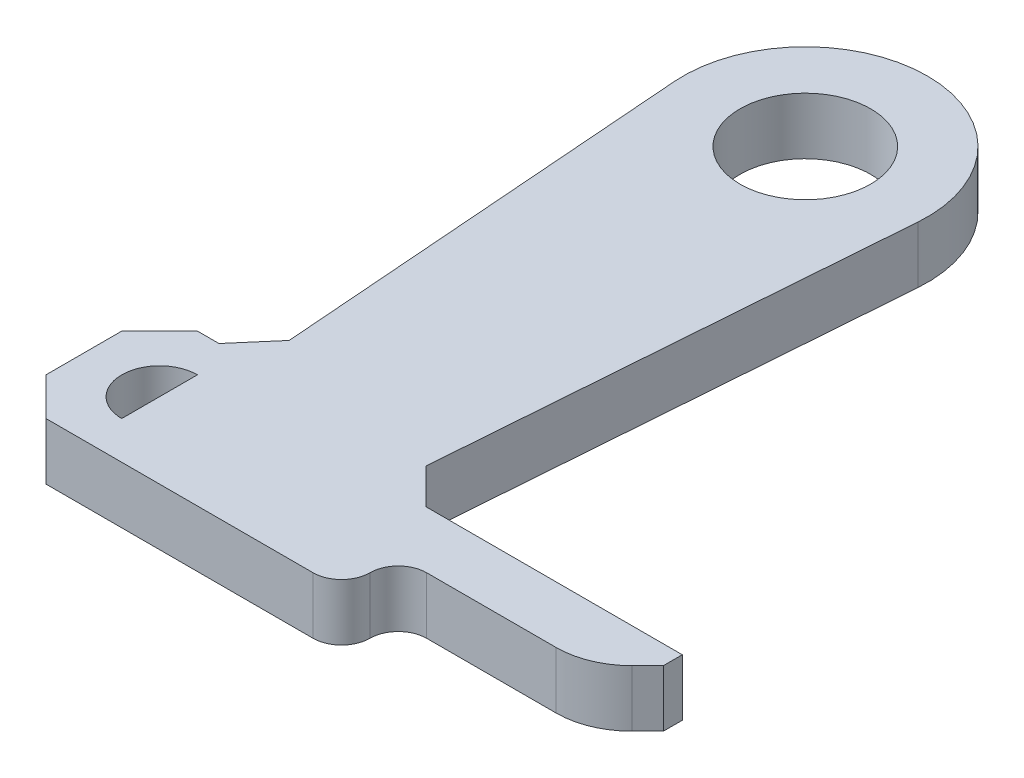
ISO-10303-21;
HEADER;
FILE_DESCRIPTION(('STEP AP214'),'2;1');
FILE_NAME('part.step','',(''),(''),'','','');
FILE_SCHEMA(('AUTOMOTIVE_DESIGN { 1 0 10303 214 1 1 1 1 }'));
ENDSEC;
DATA;
#1=APPLICATION_CONTEXT('core data for automotive mechanical design processes');
#2=APPLICATION_PROTOCOL_DEFINITION('international standard','automotive_design',2000,#1);
#3=PRODUCT_CONTEXT('',#1,'mechanical');
#4=PRODUCT('Part','Part','',(#3));
#5=PRODUCT_RELATED_PRODUCT_CATEGORY('part','',(#4));
#6=PRODUCT_DEFINITION_FORMATION('','',#4);
#7=PRODUCT_DEFINITION_CONTEXT('part definition',#1,'design');
#8=PRODUCT_DEFINITION('design','',#6,#7);
#9=PRODUCT_DEFINITION_SHAPE('','',#8);
#10=(LENGTH_UNIT() NAMED_UNIT(*) SI_UNIT(.MILLI.,.METRE.));
#11=(NAMED_UNIT(*) PLANE_ANGLE_UNIT() SI_UNIT($,.RADIAN.));
#12=(NAMED_UNIT(*) SI_UNIT($,.STERADIAN.) SOLID_ANGLE_UNIT());
#13=UNCERTAINTY_MEASURE_WITH_UNIT(LENGTH_MEASURE(1.E-05),#10,'distance_accuracy_value','');
#14=(GEOMETRIC_REPRESENTATION_CONTEXT(3) GLOBAL_UNCERTAINTY_ASSIGNED_CONTEXT((#13)) GLOBAL_UNIT_ASSIGNED_CONTEXT((#10,
#11,#12)) REPRESENTATION_CONTEXT('',''));
#15=CARTESIAN_POINT('',(0.,0.,0.));
#16=DIRECTION('',(0.,0.,1.));
#17=DIRECTION('',(1.,0.,0.));
#18=AXIS2_PLACEMENT_3D('',#15,#16,#17);
#19=CARTESIAN_POINT('',(-4.,1.5,29.05));
#20=DIRECTION('',(0.99712774336546,0.,-0.0757381238934818));
#21=DIRECTION('',(-0.0757381238934818,0.,-0.997127743365461));
#22=AXIS2_PLACEMENT_3D('',#19,#20,#21);
#23=PLANE('',#22);
#24=DIRECTION('',(0.0757381238934818,0.,0.997127743365461));
#25=VECTOR('',#24,1.);
#26=CARTESIAN_POINT('',(-4.,-1.5,29.05));
#27=LINE('',#26,#25);
#28=CARTESIAN_POINT('',(-6.43147394470722,-1.5,-2.96148910088704));
#29=VERTEX_POINT('',#28);
#30=CARTESIAN_POINT('',(-4.75912656659449,-1.5,19.0557445132691));
#31=VERTEX_POINT('',#30);
#32=EDGE_CURVE('E236',#29,#31,#27,.T.);
#33=ORIENTED_EDGE('',*,*,#32,.T.);
#34=DIRECTION('',(0.,1.,0.));
#35=VECTOR('',#34,1.);
#36=CARTESIAN_POINT('',(-4.75912656659449,1.5,19.0557445132691));
#37=LINE('',#36,#35);
#38=CARTESIAN_POINT('',(-4.75912656659449,1.5,19.0557445132691));
#39=VERTEX_POINT('',#38);
#40=EDGE_CURVE('E61',#31,#39,#37,.T.);
#41=ORIENTED_EDGE('',*,*,#40,.T.);
#42=DIRECTION('',(0.0757381238934818,0.,0.997127743365461));
#43=VECTOR('',#42,1.);
#44=CARTESIAN_POINT('',(-4.,1.5,29.05));
#45=LINE('',#44,#43);
#46=CARTESIAN_POINT('',(-6.43147394470722,1.5,-2.96148910088704));
#47=VERTEX_POINT('',#46);
#48=EDGE_CURVE('E240',#47,#39,#45,.T.);
#49=ORIENTED_EDGE('',*,*,#48,.F.);
#50=DIRECTION('',(0.,-1.,0.));
#51=VECTOR('',#50,1.);
#52=CARTESIAN_POINT('',(-6.43147394470722,1.5,-2.96148910088704));
#53=LINE('',#52,#51);
#54=EDGE_CURVE('E242',#47,#29,#53,.T.);
#55=ORIENTED_EDGE('',*,*,#54,.T.);
#56=EDGE_LOOP('',(#33,#41,#49,#55));
#57=FACE_BOUND('',#56,.T.);
#58=ADVANCED_FACE('F39',(#57),#23,.F.);
#59=CARTESIAN_POINT('',(4.,1.5,29.05));
#60=DIRECTION('',(-0.99712774336546,0.,-0.0757381238934818));
#61=DIRECTION('',(-0.0757381238934818,0.,0.997127743365461));
#62=AXIS2_PLACEMENT_3D('',#59,#60,#61);
#63=PLANE('',#62);
#64=DIRECTION('',(0.0757381238934818,0.,-0.997127743365461));
#65=VECTOR('',#64,1.);
#66=CARTESIAN_POINT('',(4.,1.5,29.05));
#67=LINE('',#66,#65);
#68=CARTESIAN_POINT('',(4.59692616946738,1.5,21.1911884303617));
#69=VERTEX_POINT('',#68);
#70=CARTESIAN_POINT('',(6.43147394470722,1.5,-2.96148910088704));
#71=VERTEX_POINT('',#70);
#72=EDGE_CURVE('E235',#69,#71,#67,.T.);
#73=ORIENTED_EDGE('',*,*,#72,.F.);
#74=DIRECTION('',(0.,-1.,0.));
#75=VECTOR('',#74,1.);
#76=CARTESIAN_POINT('',(4.59692616946738,-1.5,21.1911884303617));
#77=LINE('',#76,#75);
#78=CARTESIAN_POINT('',(4.59692616946738,-1.5,21.1911884303617));
#79=VERTEX_POINT('',#78);
#80=EDGE_CURVE('E306',#69,#79,#77,.T.);
#81=ORIENTED_EDGE('',*,*,#80,.T.);
#82=DIRECTION('',(0.0757381238934818,0.,-0.997127743365461));
#83=VECTOR('',#82,1.);
#84=CARTESIAN_POINT('',(4.,-1.5,29.05));
#85=LINE('',#84,#83);
#86=CARTESIAN_POINT('',(6.43147394470722,-1.5,-2.96148910088704));
#87=VERTEX_POINT('',#86);
#88=EDGE_CURVE('E244',#79,#87,#85,.T.);
#89=ORIENTED_EDGE('',*,*,#88,.T.);
#90=DIRECTION('',(0.,-1.,0.));
#91=VECTOR('',#90,1.);
#92=CARTESIAN_POINT('',(6.43147394470722,1.5,-2.96148910088704));
#93=LINE('',#92,#91);
#94=EDGE_CURVE('E251',#71,#87,#93,.T.);
#95=ORIENTED_EDGE('',*,*,#94,.F.);
#96=EDGE_LOOP('',(#73,#81,#89,#95));
#97=FACE_BOUND('',#96,.T.);
#98=ADVANCED_FACE('F327',(#97),#63,.F.);
#99=CARTESIAN_POINT('',(0.,1.5,-3.45));
#100=DIRECTION('',(0.,1.,0.));
#101=DIRECTION('',(0.,0.,1.));
#102=AXIS2_PLACEMENT_3D('',#99,#100,#101);
#103=PLANE('',#102);
#104=CARTESIAN_POINT('',(-5.60765031880753,1.5,25.05));
#105=DIRECTION('',(0.,1.,0.));
#106=DIRECTION('',(0.,0.,1.));
#107=AXIS2_PLACEMENT_3D('',#104,#105,#106);
#108=CIRCLE('',#107,2.);
#109=CARTESIAN_POINT('',(-5.60765031880753,1.5,23.05));
#110=VERTEX_POINT('',#109);
#111=CARTESIAN_POINT('',(-5.60765031880753,1.5,27.05));
#112=VERTEX_POINT('',#111);
#113=EDGE_CURVE('E174',#110,#112,#108,.T.);
#114=ORIENTED_EDGE('',*,*,#113,.F.);
#115=DIRECTION('',(0.,0.,-1.));
#116=VECTOR('',#115,1.);
#117=CARTESIAN_POINT('',(-5.60765031880753,1.5,23.05));
#118=LINE('',#117,#116);
#119=EDGE_CURVE('E185',#112,#110,#118,.T.);
#120=ORIENTED_EDGE('',*,*,#119,.F.);
#121=EDGE_LOOP('',(#114,#120));
#122=FACE_BOUND('',#121,.T.);
#123=DIRECTION('',(0.,0.,1.));
#124=VECTOR('',#123,1.);
#125=CARTESIAN_POINT('',(-9.60765031880753,1.5,21.05));
#126=LINE('',#125,#124);
#127=CARTESIAN_POINT('',(-9.60765031880753,1.5,23.05));
#128=VERTEX_POINT('',#127);
#129=CARTESIAN_POINT('',(-9.60765031880753,1.5,27.05));
#130=VERTEX_POINT('',#129);
#131=EDGE_CURVE('E204',#128,#130,#126,.T.);
#132=ORIENTED_EDGE('',*,*,#131,.T.);
#133=DIRECTION('',(-0.707106781186546,0.,-0.707106781186549));
#134=VECTOR('',#133,1.);
#135=CARTESIAN_POINT('',(-20.0538251594038,1.5,16.6038251594037));
#136=LINE('',#135,#134);
#137=CARTESIAN_POINT('',(-7.60765031880752,1.5,29.05));
#138=VERTEX_POINT('',#137);
#139=EDGE_CURVE('E301',#130,#138,#136,.F.);
#140=ORIENTED_EDGE('',*,*,#139,.T.);
#141=DIRECTION('',(1.,0.,0.));
#142=VECTOR('',#141,1.);
#143=CARTESIAN_POINT('',(-4.,1.5,29.05));
#144=LINE('',#143,#142);
#145=CARTESIAN_POINT('',(6.5,1.5,29.05));
#146=VERTEX_POINT('',#145);
#147=EDGE_CURVE('E233',#138,#146,#144,.T.);
#148=ORIENTED_EDGE('',*,*,#147,.T.);
#149=CARTESIAN_POINT('',(6.5,1.5,27.55));
#150=DIRECTION('',(0.,1.,0.));
#151=DIRECTION('',(0.,0.,1.));
#152=AXIS2_PLACEMENT_3D('',#149,#150,#151);
#153=CIRCLE('',#152,1.5);
#154=CARTESIAN_POINT('',(8.,1.5,27.55));
#155=VERTEX_POINT('',#154);
#156=EDGE_CURVE('E266',#146,#155,#153,.T.);
#157=ORIENTED_EDGE('',*,*,#156,.T.);
#158=CARTESIAN_POINT('',(9.5,1.5,27.55));
#159=DIRECTION('',(0.,1.,0.));
#160=DIRECTION('',(0.,0.,1.));
#161=AXIS2_PLACEMENT_3D('',#158,#159,#160);
#162=CIRCLE('',#161,1.5);
#163=CARTESIAN_POINT('',(9.5,1.5,26.05));
#164=VERTEX_POINT('',#163);
#165=EDGE_CURVE('E280',#155,#164,#162,.F.);
#166=ORIENTED_EDGE('',*,*,#165,.T.);
#167=DIRECTION('',(-1.,0.,0.));
#168=VECTOR('',#167,1.);
#169=CARTESIAN_POINT('',(20.,1.5,26.05));
#170=LINE('',#169,#168);
#171=CARTESIAN_POINT('',(16.3431457505076,1.5,26.05));
#172=VERTEX_POINT('',#171);
#173=EDGE_CURVE('E197',#172,#164,#170,.T.);
#174=ORIENTED_EDGE('',*,*,#173,.F.);
#175=CARTESIAN_POINT('',(16.3431457505076,1.5,22.05));
#176=DIRECTION('',(0.,1.,0.));
#177=DIRECTION('',(0.,0.,1.));
#178=AXIS2_PLACEMENT_3D('',#175,#176,#177);
#179=CIRCLE('',#178,4.);
#180=CARTESIAN_POINT('',(19.1715728752538,1.5,24.8784271247462));
#181=VERTEX_POINT('',#180);
#182=EDGE_CURVE('E268',#172,#181,#179,.T.);
#183=ORIENTED_EDGE('',*,*,#182,.T.);
#184=DIRECTION('',(-0.707106781186546,0.,0.707106781186549));
#185=VECTOR('',#184,1.);
#186=CARTESIAN_POINT('',(23.75,1.5,20.2999999999999));
#187=LINE('',#186,#185);
#188=CARTESIAN_POINT('',(20.,1.5,24.05));
#189=VERTEX_POINT('',#188);
#190=EDGE_CURVE('E254',#181,#189,#187,.F.);
#191=ORIENTED_EDGE('',*,*,#190,.T.);
#192=DIRECTION('',(0.,0.,-1.));
#193=VECTOR('',#192,1.);
#194=CARTESIAN_POINT('',(20.,1.5,23.05));
#195=LINE('',#194,#193);
#196=CARTESIAN_POINT('',(20.,1.5,23.05));
#197=VERTEX_POINT('',#196);
#198=EDGE_CURVE('E214',#189,#197,#195,.T.);
#199=ORIENTED_EDGE('',*,*,#198,.T.);
#200=DIRECTION('',(-1.,0.,0.));
#201=VECTOR('',#200,1.);
#202=CARTESIAN_POINT('',(4.45573773910565,1.5,23.05));
#203=LINE('',#202,#201);
#204=CARTESIAN_POINT('',(6.45573773910565,1.5,23.05));
#205=VERTEX_POINT('',#204);
#206=EDGE_CURVE('E216',#197,#205,#203,.T.);
#207=ORIENTED_EDGE('',*,*,#206,.T.);
#208=DIRECTION('',(0.707106781186544,0.,0.707106781186551));
#209=VECTOR('',#208,1.);
#210=CARTESIAN_POINT('',(4.59692616946738,1.5,21.1911884303617));
#211=LINE('',#210,#209);
#212=EDGE_CURVE('E317',#205,#69,#211,.F.);
#213=ORIENTED_EDGE('',*,*,#212,.T.);
#214=ORIENTED_EDGE('',*,*,#72,.T.);
#215=CARTESIAN_POINT('',(0.,1.5,-3.45));
#216=DIRECTION('',(0.,1.,0.));
#217=DIRECTION('',(0.,0.,1.));
#218=AXIS2_PLACEMENT_3D('',#215,#216,#217);
#219=CIRCLE('',#218,6.45);
#220=EDGE_CURVE('E238',#71,#47,#219,.T.);
#221=ORIENTED_EDGE('',*,*,#220,.T.);
#222=ORIENTED_EDGE('',*,*,#48,.T.);
#223=DIRECTION('',(0.651520848043532,0.,-0.758630730042381));
#224=VECTOR('',#223,1.);
#225=CARTESIAN_POINT('',(-6.47181625141362,1.5,21.05));
#226=LINE('',#225,#224);
#227=CARTESIAN_POINT('',(-6.47181625141362,1.5,21.05));
#228=VERTEX_POINT('',#227);
#229=EDGE_CURVE('E12',#39,#228,#226,.F.);
#230=ORIENTED_EDGE('',*,*,#229,.T.);
#231=DIRECTION('',(-1.,0.,0.));
#232=VECTOR('',#231,1.);
#233=CARTESIAN_POINT('',(-9.60765031880753,1.5,21.05));
#234=LINE('',#233,#232);
#235=CARTESIAN_POINT('',(-7.60765031880751,1.5,21.05));
#236=VERTEX_POINT('',#235);
#237=EDGE_CURVE('E207',#228,#236,#234,.T.);
#238=ORIENTED_EDGE('',*,*,#237,.T.);
#239=DIRECTION('',(0.707106781186549,0.,-0.707106781186546));
#240=VECTOR('',#239,1.);
#241=CARTESIAN_POINT('',(8.44617484059626,1.5,4.99617484059629));
#242=LINE('',#241,#240);
#243=EDGE_CURVE('E299',#236,#128,#242,.F.);
#244=ORIENTED_EDGE('',*,*,#243,.T.);
#245=EDGE_LOOP('',(#132,#140,#148,#157,#166,#174,#183,#191,#199,#207,#213,#214,#221,#222,#230,
#238,#244));
#246=FACE_BOUND('',#245,.T.);
#247=CARTESIAN_POINT('',(0.,1.5,-3.45));
#248=DIRECTION('',(0.,1.,0.));
#249=DIRECTION('',(0.,0.,1.));
#250=AXIS2_PLACEMENT_3D('',#247,#248,#249);
#251=CIRCLE('',#250,3.45);
#252=CARTESIAN_POINT('',(0.,1.5,0.));
#253=VERTEX_POINT('',#252);
#254=EDGE_CURVE('E227',#253,#253,#251,.T.);
#255=ORIENTED_EDGE('',*,*,#254,.F.);
#256=EDGE_LOOP('',(#255));
#257=FACE_BOUND('',#256,.T.);
#258=ADVANCED_FACE('F189',(#122,#246,#257),#103,.T.);
#259=CARTESIAN_POINT('',(0.,-1.5,-3.45));
#260=DIRECTION('',(0.,1.,0.));
#261=DIRECTION('',(0.,0.,1.));
#262=AXIS2_PLACEMENT_3D('',#259,#260,#261);
#263=PLANE('',#262);
#264=DIRECTION('',(0.,0.,-1.));
#265=VECTOR('',#264,1.);
#266=CARTESIAN_POINT('',(-5.60765031880753,-1.5,23.05));
#267=LINE('',#266,#265);
#268=CARTESIAN_POINT('',(-5.60765031880753,-1.5,27.05));
#269=VERTEX_POINT('',#268);
#270=CARTESIAN_POINT('',(-5.60765031880753,-1.5,23.05));
#271=VERTEX_POINT('',#270);
#272=EDGE_CURVE('E194',#269,#271,#267,.T.);
#273=ORIENTED_EDGE('',*,*,#272,.T.);
#274=CARTESIAN_POINT('',(-5.60765031880753,-1.5,25.05));
#275=DIRECTION('',(0.,1.,0.));
#276=DIRECTION('',(0.,0.,1.));
#277=AXIS2_PLACEMENT_3D('',#274,#275,#276);
#278=CIRCLE('',#277,2.);
#279=EDGE_CURVE('E177',#271,#269,#278,.T.);
#280=ORIENTED_EDGE('',*,*,#279,.T.);
#281=EDGE_LOOP('',(#273,#280));
#282=FACE_BOUND('',#281,.T.);
#283=DIRECTION('',(1.,0.,0.));
#284=VECTOR('',#283,1.);
#285=CARTESIAN_POINT('',(-4.,-1.5,29.05));
#286=LINE('',#285,#284);
#287=CARTESIAN_POINT('',(-7.60765031880752,-1.5,29.05));
#288=VERTEX_POINT('',#287);
#289=CARTESIAN_POINT('',(6.5,-1.5,29.05));
#290=VERTEX_POINT('',#289);
#291=EDGE_CURVE('E230',#288,#290,#286,.T.);
#292=ORIENTED_EDGE('',*,*,#291,.F.);
#293=DIRECTION('',(0.707106781186546,0.,0.707106781186549));
#294=VECTOR('',#293,1.);
#295=CARTESIAN_POINT('',(-7.60765031880752,-1.5,29.05));
#296=LINE('',#295,#294);
#297=CARTESIAN_POINT('',(-9.60765031880753,-1.5,27.05));
#298=VERTEX_POINT('',#297);
#299=EDGE_CURVE('E292',#288,#298,#296,.F.);
#300=ORIENTED_EDGE('',*,*,#299,.T.);
#301=DIRECTION('',(0.,0.,1.));
#302=VECTOR('',#301,1.);
#303=CARTESIAN_POINT('',(-9.60765031880753,-1.5,21.05));
#304=LINE('',#303,#302);
#305=CARTESIAN_POINT('',(-9.60765031880753,-1.5,23.05));
#306=VERTEX_POINT('',#305);
#307=EDGE_CURVE('E203',#306,#298,#304,.T.);
#308=ORIENTED_EDGE('',*,*,#307,.F.);
#309=DIRECTION('',(-0.707106781186549,0.,0.707106781186546));
#310=VECTOR('',#309,1.);
#311=CARTESIAN_POINT('',(-9.60765031880753,-1.5,23.05));
#312=LINE('',#311,#310);
#313=CARTESIAN_POINT('',(-7.60765031880751,-1.5,21.05));
#314=VERTEX_POINT('',#313);
#315=EDGE_CURVE('E289',#306,#314,#312,.F.);
#316=ORIENTED_EDGE('',*,*,#315,.T.);
#317=DIRECTION('',(-1.,0.,0.));
#318=VECTOR('',#317,1.);
#319=CARTESIAN_POINT('',(-9.60765031880753,-1.5,21.05));
#320=LINE('',#319,#318);
#321=CARTESIAN_POINT('',(-6.47181625141362,-1.5,21.05));
#322=VERTEX_POINT('',#321);
#323=EDGE_CURVE('E208',#322,#314,#320,.T.);
#324=ORIENTED_EDGE('',*,*,#323,.F.);
#325=DIRECTION('',(-0.651520848043532,0.,0.758630730042381));
#326=VECTOR('',#325,1.);
#327=CARTESIAN_POINT('',(8.38479807422438,-1.5,3.75096159522467));
#328=LINE('',#327,#326);
#329=EDGE_CURVE('E48',#322,#31,#328,.F.);
#330=ORIENTED_EDGE('',*,*,#329,.T.);
#331=ORIENTED_EDGE('',*,*,#32,.F.);
#332=CARTESIAN_POINT('',(0.,-1.5,-3.45));
#333=DIRECTION('',(0.,1.,0.));
#334=DIRECTION('',(0.,0.,1.));
#335=AXIS2_PLACEMENT_3D('',#332,#333,#334);
#336=CIRCLE('',#335,6.45);
#337=EDGE_CURVE('E246',#87,#29,#336,.T.);
#338=ORIENTED_EDGE('',*,*,#337,.F.);
#339=ORIENTED_EDGE('',*,*,#88,.F.);
#340=DIRECTION('',(-0.707106781186544,0.,-0.707106781186551));
#341=VECTOR('',#340,1.);
#342=CARTESIAN_POINT('',(-10.0221311304471,-1.5,6.57213113044703));
#343=LINE('',#342,#341);
#344=CARTESIAN_POINT('',(6.45573773910565,-1.5,23.05));
#345=VERTEX_POINT('',#344);
#346=EDGE_CURVE('E315',#79,#345,#343,.F.);
#347=ORIENTED_EDGE('',*,*,#346,.T.);
#348=DIRECTION('',(-1.,0.,0.));
#349=VECTOR('',#348,1.);
#350=CARTESIAN_POINT('',(4.45573773910565,-1.5,23.05));
#351=LINE('',#350,#349);
#352=CARTESIAN_POINT('',(20.,-1.5,23.05));
#353=VERTEX_POINT('',#352);
#354=EDGE_CURVE('E217',#353,#345,#351,.T.);
#355=ORIENTED_EDGE('',*,*,#354,.F.);
#356=DIRECTION('',(0.,0.,-1.));
#357=VECTOR('',#356,1.);
#358=CARTESIAN_POINT('',(20.,-1.5,23.05));
#359=LINE('',#358,#357);
#360=CARTESIAN_POINT('',(20.,-1.5,24.05));
#361=VERTEX_POINT('',#360);
#362=EDGE_CURVE('E210',#361,#353,#359,.T.);
#363=ORIENTED_EDGE('',*,*,#362,.F.);
#364=DIRECTION('',(0.707106781186546,0.,-0.707106781186549));
#365=VECTOR('',#364,1.);
#366=CARTESIAN_POINT('',(18.,-1.5,26.05));
#367=LINE('',#366,#365);
#368=CARTESIAN_POINT('',(19.1715728752538,-1.5,24.8784271247462));
#369=VERTEX_POINT('',#368);
#370=EDGE_CURVE('E258',#361,#369,#367,.F.);
#371=ORIENTED_EDGE('',*,*,#370,.T.);
#372=CARTESIAN_POINT('',(16.3431457505076,-1.5,22.05));
#373=DIRECTION('',(0.,1.,0.));
#374=DIRECTION('',(0.,0.,1.));
#375=AXIS2_PLACEMENT_3D('',#372,#373,#374);
#376=CIRCLE('',#375,4.);
#377=CARTESIAN_POINT('',(16.3431457505076,-1.5,26.05));
#378=VERTEX_POINT('',#377);
#379=EDGE_CURVE('E275',#369,#378,#376,.F.);
#380=ORIENTED_EDGE('',*,*,#379,.T.);
#381=DIRECTION('',(-1.,0.,0.));
#382=VECTOR('',#381,1.);
#383=CARTESIAN_POINT('',(20.,-1.5,26.05));
#384=LINE('',#383,#382);
#385=CARTESIAN_POINT('',(9.5,-1.5,26.05));
#386=VERTEX_POINT('',#385);
#387=EDGE_CURVE('E200',#378,#386,#384,.T.);
#388=ORIENTED_EDGE('',*,*,#387,.T.);
#389=CARTESIAN_POINT('',(9.5,-1.5,27.55));
#390=DIRECTION('',(0.,1.,0.));
#391=DIRECTION('',(0.,0.,1.));
#392=AXIS2_PLACEMENT_3D('',#389,#390,#391);
#393=CIRCLE('',#392,1.5);
#394=CARTESIAN_POINT('',(8.,-1.5,27.55));
#395=VERTEX_POINT('',#394);
#396=EDGE_CURVE('E282',#386,#395,#393,.T.);
#397=ORIENTED_EDGE('',*,*,#396,.T.);
#398=CARTESIAN_POINT('',(6.5,-1.5,27.55));
#399=DIRECTION('',(0.,1.,0.));
#400=DIRECTION('',(0.,0.,1.));
#401=AXIS2_PLACEMENT_3D('',#398,#399,#400);
#402=CIRCLE('',#401,1.5);
#403=EDGE_CURVE('E272',#395,#290,#402,.F.);
#404=ORIENTED_EDGE('',*,*,#403,.T.);
#405=EDGE_LOOP('',(#292,#300,#308,#316,#324,#330,#331,#338,#339,#347,#355,#363,#371,#380,#388,
#397,#404));
#406=FACE_BOUND('',#405,.T.);
#407=CARTESIAN_POINT('',(0.,-1.5,-3.45));
#408=DIRECTION('',(0.,1.,0.));
#409=DIRECTION('',(0.,0.,1.));
#410=AXIS2_PLACEMENT_3D('',#407,#408,#409);
#411=CIRCLE('',#410,3.45);
#412=CARTESIAN_POINT('',(0.,-1.5,0.));
#413=VERTEX_POINT('',#412);
#414=EDGE_CURVE('E226',#413,#413,#411,.T.);
#415=ORIENTED_EDGE('',*,*,#414,.T.);
#416=EDGE_LOOP('',(#415));
#417=FACE_BOUND('',#416,.T.);
#418=ADVANCED_FACE('F333',(#282,#406,#417),#263,.F.);
#419=CARTESIAN_POINT('',(-4.,1.5,29.05));
#420=DIRECTION('',(0.,0.,-1.));
#421=DIRECTION('',(-1.,0.,0.));
#422=AXIS2_PLACEMENT_3D('',#419,#420,#421);
#423=PLANE('',#422);
#424=ORIENTED_EDGE('',*,*,#147,.F.);
#425=DIRECTION('',(0.,-1.,0.));
#426=VECTOR('',#425,1.);
#427=CARTESIAN_POINT('',(-7.60765031880752,1.5,29.05));
#428=LINE('',#427,#426);
#429=EDGE_CURVE('E284',#138,#288,#428,.T.);
#430=ORIENTED_EDGE('',*,*,#429,.T.);
#431=ORIENTED_EDGE('',*,*,#291,.T.);
#432=DIRECTION('',(0.,1.,0.));
#433=VECTOR('',#432,1.);
#434=CARTESIAN_POINT('',(6.5,1.5,29.05));
#435=LINE('',#434,#433);
#436=EDGE_CURVE('E277',#290,#146,#435,.T.);
#437=ORIENTED_EDGE('',*,*,#436,.T.);
#438=EDGE_LOOP('',(#424,#430,#431,#437));
#439=FACE_BOUND('',#438,.T.);
#440=ADVANCED_FACE('F370',(#439),#423,.F.);
#441=CARTESIAN_POINT('',(0.,1.5,-3.45));
#442=DIRECTION('',(0.,-1.,0.));
#443=DIRECTION('',(0.,0.,-1.));
#444=AXIS2_PLACEMENT_3D('',#441,#442,#443);
#445=CYLINDRICAL_SURFACE('',#444,6.45);
#446=ORIENTED_EDGE('',*,*,#337,.T.);
#447=ORIENTED_EDGE('',*,*,#54,.F.);
#448=ORIENTED_EDGE('',*,*,#220,.F.);
#449=ORIENTED_EDGE('',*,*,#94,.T.);
#450=EDGE_LOOP('',(#446,#447,#448,#449));
#451=FACE_BOUND('',#450,.T.);
#452=ADVANCED_FACE('F393',(#451),#445,.T.);
#453=CARTESIAN_POINT('',(0.,1.5,-3.45));
#454=DIRECTION('',(0.,-1.,0.));
#455=DIRECTION('',(0.,0.,-1.));
#456=AXIS2_PLACEMENT_3D('',#453,#454,#455);
#457=CYLINDRICAL_SURFACE('',#456,3.45);
#458=ORIENTED_EDGE('',*,*,#254,.T.);
#459=EDGE_LOOP('',(#458));
#460=FACE_BOUND('',#459,.T.);
#461=ORIENTED_EDGE('',*,*,#414,.F.);
#462=EDGE_LOOP('',(#461));
#463=FACE_BOUND('',#462,.T.);
#464=ADVANCED_FACE('F395',(#460,#463),#457,.F.);
#465=CARTESIAN_POINT('',(20.,1.5,23.05));
#466=DIRECTION('',(-1.,0.,0.));
#467=DIRECTION('',(0.,0.,1.));
#468=AXIS2_PLACEMENT_3D('',#465,#466,#467);
#469=PLANE('',#468);
#470=ORIENTED_EDGE('',*,*,#198,.F.);
#471=DIRECTION('',(0.,-1.,0.));
#472=VECTOR('',#471,1.);
#473=CARTESIAN_POINT('',(20.,1.5,24.05));
#474=LINE('',#473,#472);
#475=EDGE_CURVE('E256',#189,#361,#474,.T.);
#476=ORIENTED_EDGE('',*,*,#475,.T.);
#477=ORIENTED_EDGE('',*,*,#362,.T.);
#478=DIRECTION('',(0.,-1.,0.));
#479=VECTOR('',#478,1.);
#480=CARTESIAN_POINT('',(20.,1.5,23.05));
#481=LINE('',#480,#479);
#482=EDGE_CURVE('E220',#197,#353,#481,.T.);
#483=ORIENTED_EDGE('',*,*,#482,.F.);
#484=EDGE_LOOP('',(#470,#476,#477,#483));
#485=FACE_BOUND('',#484,.T.);
#486=ADVANCED_FACE('F342',(#485),#469,.F.);
#487=CARTESIAN_POINT('',(4.45573773910565,1.5,23.05));
#488=DIRECTION('',(0.,0.,1.));
#489=DIRECTION('',(1.,0.,0.));
#490=AXIS2_PLACEMENT_3D('',#487,#488,#489);
#491=PLANE('',#490);
#492=ORIENTED_EDGE('',*,*,#354,.T.);
#493=DIRECTION('',(0.,1.,0.));
#494=VECTOR('',#493,1.);
#495=CARTESIAN_POINT('',(6.45573773910565,1.5,23.05));
#496=LINE('',#495,#494);
#497=EDGE_CURVE('E309',#345,#205,#496,.T.);
#498=ORIENTED_EDGE('',*,*,#497,.T.);
#499=ORIENTED_EDGE('',*,*,#206,.F.);
#500=ORIENTED_EDGE('',*,*,#482,.T.);
#501=EDGE_LOOP('',(#492,#498,#499,#500));
#502=FACE_BOUND('',#501,.T.);
#503=ADVANCED_FACE('F338',(#502),#491,.F.);
#504=CARTESIAN_POINT('',(-9.60765031880753,1.5,21.05));
#505=DIRECTION('',(1.,0.,0.));
#506=DIRECTION('',(0.,0.,-1.));
#507=AXIS2_PLACEMENT_3D('',#504,#505,#506);
#508=PLANE('',#507);
#509=ORIENTED_EDGE('',*,*,#307,.T.);
#510=DIRECTION('',(0.,1.,0.));
#511=VECTOR('',#510,1.);
#512=CARTESIAN_POINT('',(-9.60765031880753,1.5,27.05));
#513=LINE('',#512,#511);
#514=EDGE_CURVE('E297',#298,#130,#513,.T.);
#515=ORIENTED_EDGE('',*,*,#514,.T.);
#516=ORIENTED_EDGE('',*,*,#131,.F.);
#517=DIRECTION('',(0.,-1.,0.));
#518=VECTOR('',#517,1.);
#519=CARTESIAN_POINT('',(-9.60765031880753,1.5,23.05));
#520=LINE('',#519,#518);
#521=EDGE_CURVE('E294',#128,#306,#520,.T.);
#522=ORIENTED_EDGE('',*,*,#521,.T.);
#523=EDGE_LOOP('',(#509,#515,#516,#522));
#524=FACE_BOUND('',#523,.T.);
#525=ADVANCED_FACE('F378',(#524),#508,.F.);
#526=CARTESIAN_POINT('',(-9.60765031880753,1.5,21.05));
#527=DIRECTION('',(0.,0.,1.));
#528=DIRECTION('',(1.,0.,0.));
#529=AXIS2_PLACEMENT_3D('',#526,#527,#528);
#530=PLANE('',#529);
#531=ORIENTED_EDGE('',*,*,#237,.F.);
#532=DIRECTION('',(0.,-1.,0.));
#533=VECTOR('',#532,1.);
#534=CARTESIAN_POINT('',(-6.47181625141362,-1.5,21.05));
#535=LINE('',#534,#533);
#536=EDGE_CURVE('E311',#228,#322,#535,.T.);
#537=ORIENTED_EDGE('',*,*,#536,.T.);
#538=ORIENTED_EDGE('',*,*,#323,.T.);
#539=DIRECTION('',(0.,1.,0.));
#540=VECTOR('',#539,1.);
#541=CARTESIAN_POINT('',(-7.60765031880751,1.5,21.05));
#542=LINE('',#541,#540);
#543=EDGE_CURVE('E303',#314,#236,#542,.T.);
#544=ORIENTED_EDGE('',*,*,#543,.T.);
#545=EDGE_LOOP('',(#531,#537,#538,#544));
#546=FACE_BOUND('',#545,.T.);
#547=ADVANCED_FACE('F387',(#546),#530,.F.);
#548=CARTESIAN_POINT('',(20.,-1.5,26.05));
#549=DIRECTION('',(0.,0.,-1.));
#550=DIRECTION('',(-1.,0.,0.));
#551=AXIS2_PLACEMENT_3D('',#548,#549,#550);
#552=PLANE('',#551);
#553=ORIENTED_EDGE('',*,*,#387,.F.);
#554=DIRECTION('',(0.,-1.,0.));
#555=VECTOR('',#554,1.);
#556=CARTESIAN_POINT('',(16.3431457505076,1.5,26.05));
#557=LINE('',#556,#555);
#558=EDGE_CURVE('E263',#378,#172,#557,.F.);
#559=ORIENTED_EDGE('',*,*,#558,.T.);
#560=ORIENTED_EDGE('',*,*,#173,.T.);
#561=DIRECTION('',(0.,1.,0.));
#562=VECTOR('',#561,1.);
#563=CARTESIAN_POINT('',(9.5,-1.5,26.05));
#564=LINE('',#563,#562);
#565=EDGE_CURVE('E261',#164,#386,#564,.F.);
#566=ORIENTED_EDGE('',*,*,#565,.T.);
#567=EDGE_LOOP('',(#553,#559,#560,#566));
#568=FACE_BOUND('',#567,.T.);
#569=ADVANCED_FACE('F356',(#568),#552,.F.);
#570=CARTESIAN_POINT('',(18.,-1.5,26.05));
#571=DIRECTION('',(-0.707106781186549,0.,-0.707106781186546));
#572=DIRECTION('',(0.,1.,0.));
#573=AXIS2_PLACEMENT_3D('',#570,#571,#572);
#574=PLANE('',#573);
#575=ORIENTED_EDGE('',*,*,#190,.F.);
#576=DIRECTION('',(0.,1.,0.));
#577=VECTOR('',#576,1.);
#578=CARTESIAN_POINT('',(19.1715728752538,-1.5,24.8784271247462));
#579=LINE('',#578,#577);
#580=EDGE_CURVE('E270',#181,#369,#579,.F.);
#581=ORIENTED_EDGE('',*,*,#580,.T.);
#582=ORIENTED_EDGE('',*,*,#370,.F.);
#583=ORIENTED_EDGE('',*,*,#475,.F.);
#584=EDGE_LOOP('',(#575,#581,#582,#583));
#585=FACE_BOUND('',#584,.T.);
#586=ADVANCED_FACE('F348',(#585),#574,.F.);
#587=CARTESIAN_POINT('',(16.3431457505076,-1.5,22.05));
#588=DIRECTION('',(0.,1.,0.));
#589=DIRECTION('',(0.,0.,1.));
#590=AXIS2_PLACEMENT_3D('',#587,#588,#589);
#591=CYLINDRICAL_SURFACE('',#590,4.);
#592=ORIENTED_EDGE('',*,*,#379,.F.);
#593=ORIENTED_EDGE('',*,*,#580,.F.);
#594=ORIENTED_EDGE('',*,*,#182,.F.);
#595=ORIENTED_EDGE('',*,*,#558,.F.);
#596=EDGE_LOOP('',(#592,#593,#594,#595));
#597=FACE_BOUND('',#596,.T.);
#598=ADVANCED_FACE('F351',(#597),#591,.T.);
#599=CARTESIAN_POINT('',(9.5,-1.5,27.55));
#600=DIRECTION('',(0.,-1.,0.));
#601=DIRECTION('',(0.,0.,-1.));
#602=AXIS2_PLACEMENT_3D('',#599,#600,#601);
#603=CYLINDRICAL_SURFACE('',#602,1.5);
#604=DIRECTION('',(0.,1.,0.));
#605=VECTOR('',#604,1.);
#606=CARTESIAN_POINT('',(8.,1.5,27.55));
#607=LINE('',#606,#605);
#608=EDGE_CURVE('E181',#395,#155,#607,.T.);
#609=ORIENTED_EDGE('',*,*,#608,.F.);
#610=ORIENTED_EDGE('',*,*,#396,.F.);
#611=ORIENTED_EDGE('',*,*,#565,.F.);
#612=ORIENTED_EDGE('',*,*,#165,.F.);
#613=EDGE_LOOP('',(#609,#610,#611,#612));
#614=FACE_BOUND('',#613,.T.);
#615=ADVANCED_FACE('F362',(#614),#603,.F.);
#616=CARTESIAN_POINT('',(6.5,1.5,27.55));
#617=DIRECTION('',(0.,1.,0.));
#618=DIRECTION('',(0.,0.,1.));
#619=AXIS2_PLACEMENT_3D('',#616,#617,#618);
#620=CYLINDRICAL_SURFACE('',#619,1.5);
#621=ORIENTED_EDGE('',*,*,#403,.F.);
#622=ORIENTED_EDGE('',*,*,#608,.T.);
#623=ORIENTED_EDGE('',*,*,#156,.F.);
#624=ORIENTED_EDGE('',*,*,#436,.F.);
#625=EDGE_LOOP('',(#621,#622,#623,#624));
#626=FACE_BOUND('',#625,.T.);
#627=ADVANCED_FACE('F367',(#626),#620,.T.);
#628=CARTESIAN_POINT('',(-7.60765031880752,1.5,29.05));
#629=DIRECTION('',(0.707106781186549,0.,-0.707106781186546));
#630=DIRECTION('',(0.,-1.,0.));
#631=AXIS2_PLACEMENT_3D('',#628,#629,#630);
#632=PLANE('',#631);
#633=ORIENTED_EDGE('',*,*,#139,.F.);
#634=ORIENTED_EDGE('',*,*,#514,.F.);
#635=ORIENTED_EDGE('',*,*,#299,.F.);
#636=ORIENTED_EDGE('',*,*,#429,.F.);
#637=EDGE_LOOP('',(#633,#634,#635,#636));
#638=FACE_BOUND('',#637,.T.);
#639=ADVANCED_FACE('F374',(#638),#632,.F.);
#640=CARTESIAN_POINT('',(-9.60765031880753,1.5,23.05));
#641=DIRECTION('',(0.707106781186546,0.,0.707106781186549));
#642=DIRECTION('',(0.,-1.,0.));
#643=AXIS2_PLACEMENT_3D('',#640,#641,#642);
#644=PLANE('',#643);
#645=ORIENTED_EDGE('',*,*,#243,.F.);
#646=ORIENTED_EDGE('',*,*,#543,.F.);
#647=ORIENTED_EDGE('',*,*,#315,.F.);
#648=ORIENTED_EDGE('',*,*,#521,.F.);
#649=EDGE_LOOP('',(#645,#646,#647,#648));
#650=FACE_BOUND('',#649,.T.);
#651=ADVANCED_FACE('F383',(#650),#644,.F.);
#652=CARTESIAN_POINT('',(-5.60765031880753,-1.5,25.05));
#653=DIRECTION('',(0.,1.,0.));
#654=DIRECTION('',(0.,0.,1.));
#655=AXIS2_PLACEMENT_3D('',#652,#653,#654);
#656=CYLINDRICAL_SURFACE('',#655,2.);
#657=DIRECTION('',(0.,1.,0.));
#658=VECTOR('',#657,1.);
#659=CARTESIAN_POINT('',(-5.60765031880753,-1.5,27.05));
#660=LINE('',#659,#658);
#661=EDGE_CURVE('E182',#269,#112,#660,.T.);
#662=ORIENTED_EDGE('',*,*,#661,.F.);
#663=ORIENTED_EDGE('',*,*,#279,.F.);
#664=DIRECTION('',(0.,1.,0.));
#665=VECTOR('',#664,1.);
#666=CARTESIAN_POINT('',(-5.60765031880753,-1.5,23.05));
#667=LINE('',#666,#665);
#668=EDGE_CURVE('E170',#271,#110,#667,.T.);
#669=ORIENTED_EDGE('',*,*,#668,.T.);
#670=ORIENTED_EDGE('',*,*,#113,.T.);
#671=EDGE_LOOP('',(#662,#663,#669,#670));
#672=FACE_BOUND('',#671,.T.);
#673=ADVANCED_FACE('F172',(#672),#656,.F.);
#674=CARTESIAN_POINT('',(-5.60765031880753,-1.5,23.05));
#675=DIRECTION('',(1.,0.,0.));
#676=DIRECTION('',(0.,0.,-1.));
#677=AXIS2_PLACEMENT_3D('',#674,#675,#676);
#678=PLANE('',#677);
#679=ORIENTED_EDGE('',*,*,#668,.F.);
#680=ORIENTED_EDGE('',*,*,#272,.F.);
#681=ORIENTED_EDGE('',*,*,#661,.T.);
#682=ORIENTED_EDGE('',*,*,#119,.T.);
#683=EDGE_LOOP('',(#679,#680,#681,#682));
#684=FACE_BOUND('',#683,.T.);
#685=ADVANCED_FACE('F186',(#684),#678,.F.);
#686=CARTESIAN_POINT('',(4.59692616946738,1.5,21.1911884303617));
#687=DIRECTION('',(0.707106781186551,0.,-0.707106781186544));
#688=DIRECTION('',(0.,1.,0.));
#689=AXIS2_PLACEMENT_3D('',#686,#687,#688);
#690=PLANE('',#689);
#691=ORIENTED_EDGE('',*,*,#212,.F.);
#692=ORIENTED_EDGE('',*,*,#497,.F.);
#693=ORIENTED_EDGE('',*,*,#346,.F.);
#694=ORIENTED_EDGE('',*,*,#80,.F.);
#695=EDGE_LOOP('',(#691,#692,#693,#694));
#696=FACE_BOUND('',#695,.T.);
#697=ADVANCED_FACE('F330',(#696),#690,.T.);
#698=CARTESIAN_POINT('',(-6.47181625141362,1.5,21.05));
#699=DIRECTION('',(-0.758630730042381,0.,-0.651520848043532));
#700=DIRECTION('',(0.,1.,0.));
#701=AXIS2_PLACEMENT_3D('',#698,#699,#700);
#702=PLANE('',#701);
#703=ORIENTED_EDGE('',*,*,#229,.F.);
#704=ORIENTED_EDGE('',*,*,#40,.F.);
#705=ORIENTED_EDGE('',*,*,#329,.F.);
#706=ORIENTED_EDGE('',*,*,#536,.F.);
#707=EDGE_LOOP('',(#703,#704,#705,#706));
#708=FACE_BOUND('',#707,.T.);
#709=ADVANCED_FACE('F42',(#708),#702,.T.);
#710=CLOSED_SHELL('',(#58,#98,#258,#418,#440,#452,#464,#486,#503,#525,#547,#569,#586,#598,#615,
#627,#639,#651,#673,#685,#697,#709));
#711=MANIFOLD_SOLID_BREP('B2',#710);
#712=ADVANCED_BREP_SHAPE_REPRESENTATION('',(#18,#711),#14);
#713=SHAPE_DEFINITION_REPRESENTATION(#9,#712);
ENDSEC;
END-ISO-10303-21;
